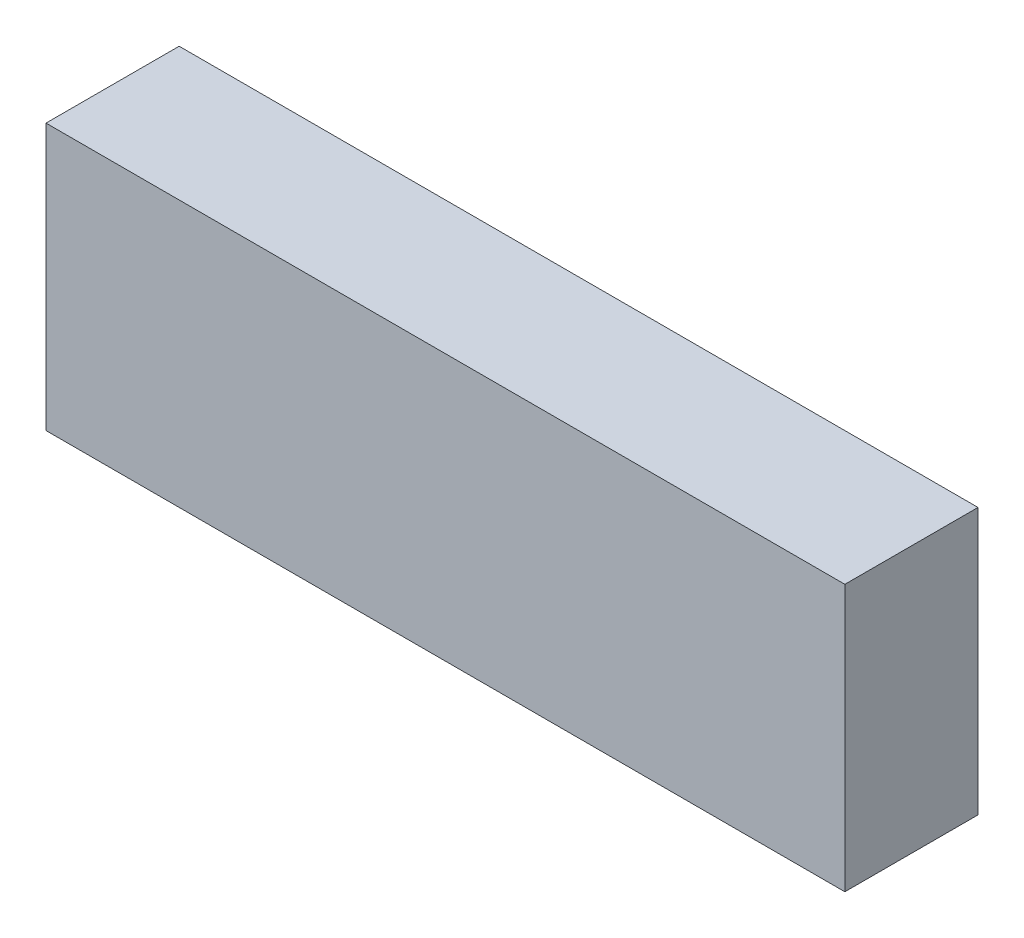
ISO-10303-21;
HEADER;
FILE_DESCRIPTION(('STEP AP214'),'2;1');
FILE_NAME('part.step','',(''),(''),'','','');
FILE_SCHEMA(('AUTOMOTIVE_DESIGN { 1 0 10303 214 1 1 1 1 }'));
ENDSEC;
DATA;
#1=APPLICATION_CONTEXT('core data for automotive mechanical design processes');
#2=APPLICATION_PROTOCOL_DEFINITION('international standard','automotive_design',2000,#1);
#3=PRODUCT_CONTEXT('',#1,'mechanical');
#4=PRODUCT('Part','Part','',(#3));
#5=PRODUCT_RELATED_PRODUCT_CATEGORY('part','',(#4));
#6=PRODUCT_DEFINITION_FORMATION('','',#4);
#7=PRODUCT_DEFINITION_CONTEXT('part definition',#1,'design');
#8=PRODUCT_DEFINITION('design','',#6,#7);
#9=PRODUCT_DEFINITION_SHAPE('','',#8);
#10=(LENGTH_UNIT() NAMED_UNIT(*) SI_UNIT(.MILLI.,.METRE.));
#11=(NAMED_UNIT(*) PLANE_ANGLE_UNIT() SI_UNIT($,.RADIAN.));
#12=(NAMED_UNIT(*) SI_UNIT($,.STERADIAN.) SOLID_ANGLE_UNIT());
#13=UNCERTAINTY_MEASURE_WITH_UNIT(LENGTH_MEASURE(1.E-05),#10,'distance_accuracy_value','');
#14=(GEOMETRIC_REPRESENTATION_CONTEXT(3) GLOBAL_UNCERTAINTY_ASSIGNED_CONTEXT((#13)) GLOBAL_UNIT_ASSIGNED_CONTEXT((#10,
#11,#12)) REPRESENTATION_CONTEXT('',''));
#15=CARTESIAN_POINT('',(0.,0.,0.));
#16=DIRECTION('',(0.,0.,1.));
#17=DIRECTION('',(1.,0.,0.));
#18=AXIS2_PLACEMENT_3D('',#15,#16,#17);
#19=CARTESIAN_POINT('',(1.375,-0.575,0.));
#20=DIRECTION('',(1.,0.,0.));
#21=DIRECTION('',(0.,0.,1.));
#22=AXIS2_PLACEMENT_3D('',#19,#20,#21);
#23=PLANE('',#22);
#24=DIRECTION('',(0.,1.,0.));
#25=VECTOR('',#24,1.);
#26=CARTESIAN_POINT('',(1.375,-0.575,0.1));
#27=LINE('',#26,#25);
#28=CARTESIAN_POINT('',(1.375,-0.575,0.1));
#29=VERTEX_POINT('',#28);
#30=CARTESIAN_POINT('',(1.375,-0.375,0.1));
#31=VERTEX_POINT('',#30);
#32=EDGE_CURVE('E11',#29,#31,#27,.T.);
#33=ORIENTED_EDGE('',*,*,#32,.T.);
#34=DIRECTION('',(0.,0.,1.));
#35=VECTOR('',#34,1.);
#36=CARTESIAN_POINT('',(1.375,-0.375,0.));
#37=LINE('',#36,#35);
#38=CARTESIAN_POINT('',(1.375,-0.375,0.));
#39=VERTEX_POINT('',#38);
#40=EDGE_CURVE('E24',#39,#31,#37,.T.);
#41=ORIENTED_EDGE('',*,*,#40,.F.);
#42=DIRECTION('',(0.,1.,0.));
#43=VECTOR('',#42,1.);
#44=CARTESIAN_POINT('',(1.375,-0.575,0.));
#45=LINE('',#44,#43);
#46=CARTESIAN_POINT('',(1.375,-0.575,0.));
#47=VERTEX_POINT('',#46);
#48=EDGE_CURVE('E86',#47,#39,#45,.T.);
#49=ORIENTED_EDGE('',*,*,#48,.F.);
#50=DIRECTION('',(0.,0.,1.));
#51=VECTOR('',#50,1.);
#52=CARTESIAN_POINT('',(1.375,-0.575,0.));
#53=LINE('',#52,#51);
#54=EDGE_CURVE('E36',#47,#29,#53,.T.);
#55=ORIENTED_EDGE('',*,*,#54,.T.);
#56=EDGE_LOOP('',(#33,#41,#49,#55));
#57=FACE_BOUND('',#56,.T.);
#58=ADVANCED_FACE('F17',(#57),#23,.F.);
#59=CARTESIAN_POINT('',(1.975,-0.575,0.));
#60=DIRECTION('',(1.,0.,0.));
#61=DIRECTION('',(0.,0.,1.));
#62=AXIS2_PLACEMENT_3D('',#59,#60,#61);
#63=PLANE('',#62);
#64=DIRECTION('',(0.,0.,1.));
#65=VECTOR('',#64,1.);
#66=CARTESIAN_POINT('',(1.975,-0.575,0.));
#67=LINE('',#66,#65);
#68=CARTESIAN_POINT('',(1.975,-0.575,0.));
#69=VERTEX_POINT('',#68);
#70=CARTESIAN_POINT('',(1.975,-0.575,0.1));
#71=VERTEX_POINT('',#70);
#72=EDGE_CURVE('E83',#69,#71,#67,.T.);
#73=ORIENTED_EDGE('',*,*,#72,.F.);
#74=DIRECTION('',(0.,1.,0.));
#75=VECTOR('',#74,1.);
#76=CARTESIAN_POINT('',(1.975,-0.575,0.));
#77=LINE('',#76,#75);
#78=CARTESIAN_POINT('',(1.975,-0.375,0.));
#79=VERTEX_POINT('',#78);
#80=EDGE_CURVE('E63',#69,#79,#77,.T.);
#81=ORIENTED_EDGE('',*,*,#80,.T.);
#82=DIRECTION('',(0.,0.,1.));
#83=VECTOR('',#82,1.);
#84=CARTESIAN_POINT('',(1.975,-0.375,0.));
#85=LINE('',#84,#83);
#86=CARTESIAN_POINT('',(1.975,-0.375,0.1));
#87=VERTEX_POINT('',#86);
#88=EDGE_CURVE('E57',#79,#87,#85,.T.);
#89=ORIENTED_EDGE('',*,*,#88,.T.);
#90=DIRECTION('',(0.,1.,0.));
#91=VECTOR('',#90,1.);
#92=CARTESIAN_POINT('',(1.975,-0.575,0.1));
#93=LINE('',#92,#91);
#94=EDGE_CURVE('E60',#71,#87,#93,.T.);
#95=ORIENTED_EDGE('',*,*,#94,.F.);
#96=EDGE_LOOP('',(#73,#81,#89,#95));
#97=FACE_BOUND('',#96,.T.);
#98=ADVANCED_FACE('F59',(#97),#63,.T.);
#99=CARTESIAN_POINT('',(1.375,-0.575,0.));
#100=DIRECTION('',(0.,1.,0.));
#101=DIRECTION('',(0.,0.,1.));
#102=AXIS2_PLACEMENT_3D('',#99,#100,#101);
#103=PLANE('',#102);
#104=ORIENTED_EDGE('',*,*,#72,.T.);
#105=DIRECTION('',(1.,0.,0.));
#106=VECTOR('',#105,1.);
#107=CARTESIAN_POINT('',(1.375,-0.575,0.1));
#108=LINE('',#107,#106);
#109=EDGE_CURVE('E71',#29,#71,#108,.T.);
#110=ORIENTED_EDGE('',*,*,#109,.F.);
#111=ORIENTED_EDGE('',*,*,#54,.F.);
#112=DIRECTION('',(1.,0.,0.));
#113=VECTOR('',#112,1.);
#114=CARTESIAN_POINT('',(1.375,-0.575,0.));
#115=LINE('',#114,#113);
#116=EDGE_CURVE('E76',#47,#69,#115,.T.);
#117=ORIENTED_EDGE('',*,*,#116,.T.);
#118=EDGE_LOOP('',(#104,#110,#111,#117));
#119=FACE_BOUND('',#118,.T.);
#120=ADVANCED_FACE('F91',(#119),#103,.F.);
#121=CARTESIAN_POINT('',(1.375,-0.375,0.));
#122=DIRECTION('',(0.,1.,0.));
#123=DIRECTION('',(0.,0.,1.));
#124=AXIS2_PLACEMENT_3D('',#121,#122,#123);
#125=PLANE('',#124);
#126=DIRECTION('',(1.,0.,0.));
#127=VECTOR('',#126,1.);
#128=CARTESIAN_POINT('',(1.375,-0.375,0.));
#129=LINE('',#128,#127);
#130=EDGE_CURVE('E74',#39,#79,#129,.T.);
#131=ORIENTED_EDGE('',*,*,#130,.F.);
#132=ORIENTED_EDGE('',*,*,#40,.T.);
#133=DIRECTION('',(1.,0.,0.));
#134=VECTOR('',#133,1.);
#135=CARTESIAN_POINT('',(1.375,-0.375,0.1));
#136=LINE('',#135,#134);
#137=EDGE_CURVE('E69',#31,#87,#136,.T.);
#138=ORIENTED_EDGE('',*,*,#137,.T.);
#139=ORIENTED_EDGE('',*,*,#88,.F.);
#140=EDGE_LOOP('',(#131,#132,#138,#139));
#141=FACE_BOUND('',#140,.T.);
#142=ADVANCED_FACE('F73',(#141),#125,.T.);
#143=CARTESIAN_POINT('',(1.375,-0.575,0.));
#144=DIRECTION('',(0.,0.,1.));
#145=DIRECTION('',(1.,0.,0.));
#146=AXIS2_PLACEMENT_3D('',#143,#144,#145);
#147=PLANE('',#146);
#148=ORIENTED_EDGE('',*,*,#130,.T.);
#149=ORIENTED_EDGE('',*,*,#80,.F.);
#150=ORIENTED_EDGE('',*,*,#116,.F.);
#151=ORIENTED_EDGE('',*,*,#48,.T.);
#152=EDGE_LOOP('',(#148,#149,#150,#151));
#153=FACE_BOUND('',#152,.T.);
#154=ADVANCED_FACE('F89',(#153),#147,.F.);
#155=CARTESIAN_POINT('',(1.375,-0.575,0.1));
#156=DIRECTION('',(0.,0.,1.));
#157=DIRECTION('',(1.,0.,0.));
#158=AXIS2_PLACEMENT_3D('',#155,#156,#157);
#159=PLANE('',#158);
#160=ORIENTED_EDGE('',*,*,#32,.F.);
#161=ORIENTED_EDGE('',*,*,#109,.T.);
#162=ORIENTED_EDGE('',*,*,#94,.T.);
#163=ORIENTED_EDGE('',*,*,#137,.F.);
#164=EDGE_LOOP('',(#160,#161,#162,#163));
#165=FACE_BOUND('',#164,.T.);
#166=ADVANCED_FACE('F68',(#165),#159,.T.);
#167=CLOSED_SHELL('',(#58,#98,#120,#142,#154,#166));
#168=MANIFOLD_SOLID_BREP('B1',#167);
#169=ADVANCED_BREP_SHAPE_REPRESENTATION('',(#18,#168),#14);
#170=SHAPE_DEFINITION_REPRESENTATION(#9,#169);
ENDSEC;
END-ISO-10303-21;
